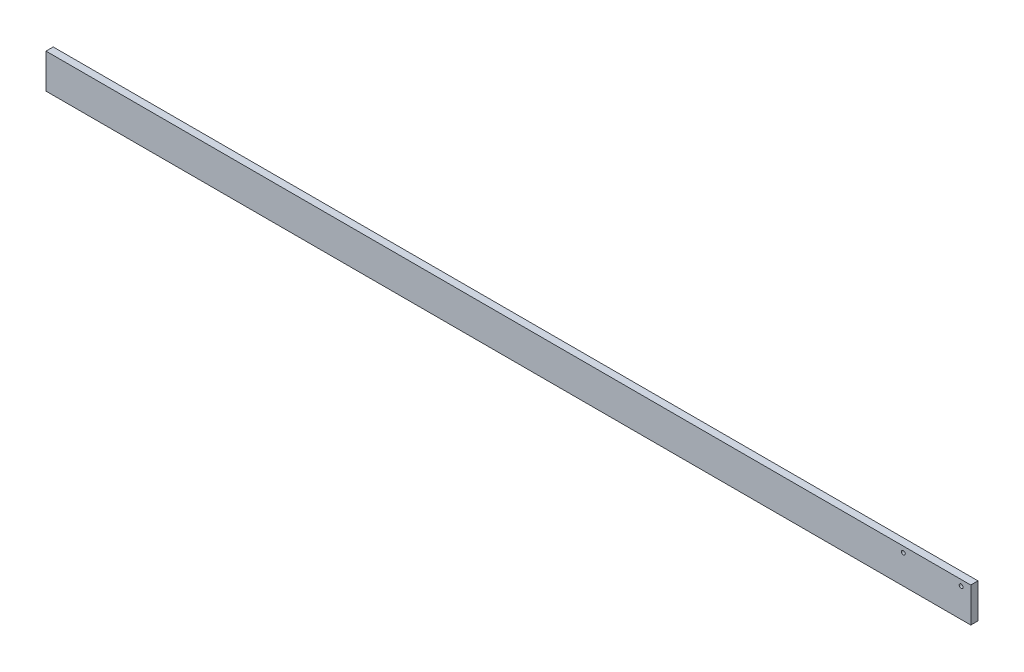
ISO-10303-21;
HEADER;
FILE_DESCRIPTION(('STEP AP214'),'2;1');
FILE_NAME('part.step','',(''),(''),'','','');
FILE_SCHEMA(('AUTOMOTIVE_DESIGN { 1 0 10303 214 1 1 1 1 }'));
ENDSEC;
DATA;
#1=APPLICATION_CONTEXT('core data for automotive mechanical design processes');
#2=APPLICATION_PROTOCOL_DEFINITION('international standard','automotive_design',2000,#1);
#3=PRODUCT_CONTEXT('',#1,'mechanical');
#4=PRODUCT('Part','Part','',(#3));
#5=PRODUCT_RELATED_PRODUCT_CATEGORY('part','',(#4));
#6=PRODUCT_DEFINITION_FORMATION('','',#4);
#7=PRODUCT_DEFINITION_CONTEXT('part definition',#1,'design');
#8=PRODUCT_DEFINITION('design','',#6,#7);
#9=PRODUCT_DEFINITION_SHAPE('','',#8);
#10=(LENGTH_UNIT() NAMED_UNIT(*) SI_UNIT(.MILLI.,.METRE.));
#11=(NAMED_UNIT(*) PLANE_ANGLE_UNIT() SI_UNIT($,.RADIAN.));
#12=(NAMED_UNIT(*) SI_UNIT($,.STERADIAN.) SOLID_ANGLE_UNIT());
#13=UNCERTAINTY_MEASURE_WITH_UNIT(LENGTH_MEASURE(1.E-05),#10,'distance_accuracy_value','');
#14=(GEOMETRIC_REPRESENTATION_CONTEXT(3) GLOBAL_UNCERTAINTY_ASSIGNED_CONTEXT((#13)) GLOBAL_UNIT_ASSIGNED_CONTEXT((#10,
#11,#12)) REPRESENTATION_CONTEXT('',''));
#15=CARTESIAN_POINT('',(0.,0.,0.));
#16=DIRECTION('',(0.,0.,1.));
#17=DIRECTION('',(1.,0.,0.));
#18=AXIS2_PLACEMENT_3D('',#15,#16,#17);
#19=CARTESIAN_POINT('',(304.8,-11.43,2.38125));
#20=DIRECTION('',(-1.,0.,0.));
#21=DIRECTION('',(0.,0.,1.));
#22=AXIS2_PLACEMENT_3D('',#19,#20,#21);
#23=PLANE('',#22);
#24=DIRECTION('',(0.,1.,0.));
#25=VECTOR('',#24,1.);
#26=CARTESIAN_POINT('',(304.8,-11.43,-2.38125));
#27=LINE('',#26,#25);
#28=CARTESIAN_POINT('',(304.8,-11.43,-2.38125));
#29=VERTEX_POINT('',#28);
#30=CARTESIAN_POINT('',(304.8,11.43,-2.38125));
#31=VERTEX_POINT('',#30);
#32=EDGE_CURVE('E99',#29,#31,#27,.T.);
#33=ORIENTED_EDGE('',*,*,#32,.T.);
#34=DIRECTION('',(0.,0.,-1.));
#35=VECTOR('',#34,1.);
#36=CARTESIAN_POINT('',(304.8,11.43,2.38125));
#37=LINE('',#36,#35);
#38=CARTESIAN_POINT('',(304.8,11.43,2.38125));
#39=VERTEX_POINT('',#38);
#40=EDGE_CURVE('E11',#39,#31,#37,.T.);
#41=ORIENTED_EDGE('',*,*,#40,.F.);
#42=DIRECTION('',(0.,1.,0.));
#43=VECTOR('',#42,1.);
#44=CARTESIAN_POINT('',(304.8,-11.43,2.38125));
#45=LINE('',#44,#43);
#46=CARTESIAN_POINT('',(304.8,-11.43,2.38125));
#47=VERTEX_POINT('',#46);
#48=EDGE_CURVE('E87',#47,#39,#45,.T.);
#49=ORIENTED_EDGE('',*,*,#48,.F.);
#50=DIRECTION('',(0.,0.,-1.));
#51=VECTOR('',#50,1.);
#52=CARTESIAN_POINT('',(304.8,-11.43,2.38125));
#53=LINE('',#52,#51);
#54=EDGE_CURVE('E95',#47,#29,#53,.T.);
#55=ORIENTED_EDGE('',*,*,#54,.T.);
#56=EDGE_LOOP('',(#33,#41,#49,#55));
#57=FACE_BOUND('',#56,.T.);
#58=ADVANCED_FACE('F36',(#57),#23,.F.);
#59=CARTESIAN_POINT('',(-304.8,11.43,2.38125));
#60=DIRECTION('',(0.,-1.,0.));
#61=DIRECTION('',(0.,0.,-1.));
#62=AXIS2_PLACEMENT_3D('',#59,#60,#61);
#63=PLANE('',#62);
#64=DIRECTION('',(-1.,0.,0.));
#65=VECTOR('',#64,1.);
#66=CARTESIAN_POINT('',(-304.8,11.43,-2.38125));
#67=LINE('',#66,#65);
#68=CARTESIAN_POINT('',(-304.8,11.43,-2.38125));
#69=VERTEX_POINT('',#68);
#70=EDGE_CURVE('E91',#31,#69,#67,.T.);
#71=ORIENTED_EDGE('',*,*,#70,.T.);
#72=DIRECTION('',(0.,0.,-1.));
#73=VECTOR('',#72,1.);
#74=CARTESIAN_POINT('',(-304.8,11.43,2.38125));
#75=LINE('',#74,#73);
#76=CARTESIAN_POINT('',(-304.8,11.43,2.38125));
#77=VERTEX_POINT('',#76);
#78=EDGE_CURVE('E44',#77,#69,#75,.T.);
#79=ORIENTED_EDGE('',*,*,#78,.F.);
#80=DIRECTION('',(-1.,0.,0.));
#81=VECTOR('',#80,1.);
#82=CARTESIAN_POINT('',(-304.8,11.43,2.38125));
#83=LINE('',#82,#81);
#84=EDGE_CURVE('E82',#39,#77,#83,.T.);
#85=ORIENTED_EDGE('',*,*,#84,.F.);
#86=ORIENTED_EDGE('',*,*,#40,.T.);
#87=EDGE_LOOP('',(#71,#79,#85,#86));
#88=FACE_BOUND('',#87,.T.);
#89=ADVANCED_FACE('F90',(#88),#63,.F.);
#90=CARTESIAN_POINT('',(-304.8,-11.43,2.38125));
#91=DIRECTION('',(1.,0.,0.));
#92=DIRECTION('',(0.,0.,-1.));
#93=AXIS2_PLACEMENT_3D('',#90,#91,#92);
#94=PLANE('',#93);
#95=DIRECTION('',(0.,-1.,0.));
#96=VECTOR('',#95,1.);
#97=CARTESIAN_POINT('',(-304.8,-11.43,-2.38125));
#98=LINE('',#97,#96);
#99=CARTESIAN_POINT('',(-304.8,-11.43,-2.38125));
#100=VERTEX_POINT('',#99);
#101=EDGE_CURVE('E69',#69,#100,#98,.T.);
#102=ORIENTED_EDGE('',*,*,#101,.T.);
#103=DIRECTION('',(0.,0.,-1.));
#104=VECTOR('',#103,1.);
#105=CARTESIAN_POINT('',(-304.8,-11.43,2.38125));
#106=LINE('',#105,#104);
#107=CARTESIAN_POINT('',(-304.8,-11.43,2.38125));
#108=VERTEX_POINT('',#107);
#109=EDGE_CURVE('E92',#108,#100,#106,.T.);
#110=ORIENTED_EDGE('',*,*,#109,.F.);
#111=DIRECTION('',(0.,-1.,0.));
#112=VECTOR('',#111,1.);
#113=CARTESIAN_POINT('',(-304.8,-11.43,2.38125));
#114=LINE('',#113,#112);
#115=EDGE_CURVE('E85',#77,#108,#114,.T.);
#116=ORIENTED_EDGE('',*,*,#115,.F.);
#117=ORIENTED_EDGE('',*,*,#78,.T.);
#118=EDGE_LOOP('',(#102,#110,#116,#117));
#119=FACE_BOUND('',#118,.T.);
#120=ADVANCED_FACE('F93',(#119),#94,.F.);
#121=CARTESIAN_POINT('',(-304.8,-11.43,2.38125));
#122=DIRECTION('',(0.,1.,0.));
#123=DIRECTION('',(0.,0.,1.));
#124=AXIS2_PLACEMENT_3D('',#121,#122,#123);
#125=PLANE('',#124);
#126=DIRECTION('',(1.,0.,0.));
#127=VECTOR('',#126,1.);
#128=CARTESIAN_POINT('',(-304.8,-11.43,-2.38125));
#129=LINE('',#128,#127);
#130=EDGE_CURVE('E75',#100,#29,#129,.T.);
#131=ORIENTED_EDGE('',*,*,#130,.T.);
#132=ORIENTED_EDGE('',*,*,#54,.F.);
#133=DIRECTION('',(1.,0.,0.));
#134=VECTOR('',#133,1.);
#135=CARTESIAN_POINT('',(-304.8,-11.43,2.38125));
#136=LINE('',#135,#134);
#137=EDGE_CURVE('E52',#108,#47,#136,.T.);
#138=ORIENTED_EDGE('',*,*,#137,.F.);
#139=ORIENTED_EDGE('',*,*,#109,.T.);
#140=EDGE_LOOP('',(#131,#132,#138,#139));
#141=FACE_BOUND('',#140,.T.);
#142=ADVANCED_FACE('F107',(#141),#125,.F.);
#143=CARTESIAN_POINT('',(0.,0.,2.38125));
#144=DIRECTION('',(0.,0.,-1.));
#145=DIRECTION('',(-1.,0.,0.));
#146=AXIS2_PLACEMENT_3D('',#143,#144,#145);
#147=PLANE('',#146);
#148=CARTESIAN_POINT('',(260.35,7.62,2.38125));
#149=DIRECTION('',(0.,0.,1.));
#150=DIRECTION('',(1.,0.,0.));
#151=AXIS2_PLACEMENT_3D('',#148,#149,#150);
#152=CIRCLE('',#151,1.26999999999998);
#153=CARTESIAN_POINT('',(261.62,7.62,2.38125));
#154=VERTEX_POINT('',#153);
#155=EDGE_CURVE('E119',#154,#154,#152,.T.);
#156=ORIENTED_EDGE('',*,*,#155,.F.);
#157=EDGE_LOOP('',(#156));
#158=FACE_BOUND('',#157,.T.);
#159=CARTESIAN_POINT('',(298.45,7.62,2.38125));
#160=DIRECTION('',(0.,0.,1.));
#161=DIRECTION('',(1.,0.,0.));
#162=AXIS2_PLACEMENT_3D('',#159,#160,#161);
#163=CIRCLE('',#162,1.26999999999998);
#164=CARTESIAN_POINT('',(299.72,7.62,2.38125));
#165=VERTEX_POINT('',#164);
#166=EDGE_CURVE('E116',#165,#165,#163,.T.);
#167=ORIENTED_EDGE('',*,*,#166,.F.);
#168=EDGE_LOOP('',(#167));
#169=FACE_BOUND('',#168,.T.);
#170=ORIENTED_EDGE('',*,*,#48,.T.);
#171=ORIENTED_EDGE('',*,*,#84,.T.);
#172=ORIENTED_EDGE('',*,*,#115,.T.);
#173=ORIENTED_EDGE('',*,*,#137,.T.);
#174=EDGE_LOOP('',(#170,#171,#172,#173));
#175=FACE_BOUND('',#174,.T.);
#176=ADVANCED_FACE('F83',(#158,#169,#175),#147,.F.);
#177=CARTESIAN_POINT('',(0.,0.,-2.38125));
#178=DIRECTION('',(0.,0.,-1.));
#179=DIRECTION('',(-1.,0.,0.));
#180=AXIS2_PLACEMENT_3D('',#177,#178,#179);
#181=PLANE('',#180);
#182=CARTESIAN_POINT('',(260.35,7.62,-2.38125));
#183=DIRECTION('',(0.,0.,1.));
#184=DIRECTION('',(1.,0.,0.));
#185=AXIS2_PLACEMENT_3D('',#182,#183,#184);
#186=CIRCLE('',#185,1.26999999999998);
#187=CARTESIAN_POINT('',(261.62,7.62,-2.38125));
#188=VERTEX_POINT('',#187);
#189=EDGE_CURVE('E102',#188,#188,#186,.T.);
#190=ORIENTED_EDGE('',*,*,#189,.T.);
#191=EDGE_LOOP('',(#190));
#192=FACE_BOUND('',#191,.T.);
#193=CARTESIAN_POINT('',(298.45,7.62,-2.38125));
#194=DIRECTION('',(0.,0.,1.));
#195=DIRECTION('',(1.,0.,0.));
#196=AXIS2_PLACEMENT_3D('',#193,#194,#195);
#197=CIRCLE('',#196,1.26999999999998);
#198=CARTESIAN_POINT('',(299.72,7.62,-2.38125));
#199=VERTEX_POINT('',#198);
#200=EDGE_CURVE('E113',#199,#199,#197,.T.);
#201=ORIENTED_EDGE('',*,*,#200,.T.);
#202=EDGE_LOOP('',(#201));
#203=FACE_BOUND('',#202,.T.);
#204=ORIENTED_EDGE('',*,*,#32,.F.);
#205=ORIENTED_EDGE('',*,*,#130,.F.);
#206=ORIENTED_EDGE('',*,*,#101,.F.);
#207=ORIENTED_EDGE('',*,*,#70,.F.);
#208=EDGE_LOOP('',(#204,#205,#206,#207));
#209=FACE_BOUND('',#208,.T.);
#210=ADVANCED_FACE('F110',(#192,#203,#209),#181,.T.);
#211=CARTESIAN_POINT('',(298.45,7.62,-2.38125));
#212=DIRECTION('',(0.,0.,1.));
#213=DIRECTION('',(1.,0.,0.));
#214=AXIS2_PLACEMENT_3D('',#211,#212,#213);
#215=CYLINDRICAL_SURFACE('',#214,1.26999999999998);
#216=ORIENTED_EDGE('',*,*,#200,.F.);
#217=EDGE_LOOP('',(#216));
#218=FACE_BOUND('',#217,.T.);
#219=ORIENTED_EDGE('',*,*,#166,.T.);
#220=EDGE_LOOP('',(#219));
#221=FACE_BOUND('',#220,.T.);
#222=ADVANCED_FACE('F130',(#218,#221),#215,.F.);
#223=CARTESIAN_POINT('',(260.35,7.62,-2.38125));
#224=DIRECTION('',(0.,0.,1.));
#225=DIRECTION('',(1.,0.,0.));
#226=AXIS2_PLACEMENT_3D('',#223,#224,#225);
#227=CYLINDRICAL_SURFACE('',#226,1.26999999999998);
#228=ORIENTED_EDGE('',*,*,#189,.F.);
#229=EDGE_LOOP('',(#228));
#230=FACE_BOUND('',#229,.T.);
#231=ORIENTED_EDGE('',*,*,#155,.T.);
#232=EDGE_LOOP('',(#231));
#233=FACE_BOUND('',#232,.T.);
#234=ADVANCED_FACE('F127',(#230,#233),#227,.F.);
#235=CLOSED_SHELL('',(#58,#89,#120,#142,#176,#210,#222,#234));
#236=MANIFOLD_SOLID_BREP('B2',#235);
#237=ADVANCED_BREP_SHAPE_REPRESENTATION('',(#18,#236),#14);
#238=SHAPE_DEFINITION_REPRESENTATION(#9,#237);
ENDSEC;
END-ISO-10303-21;
